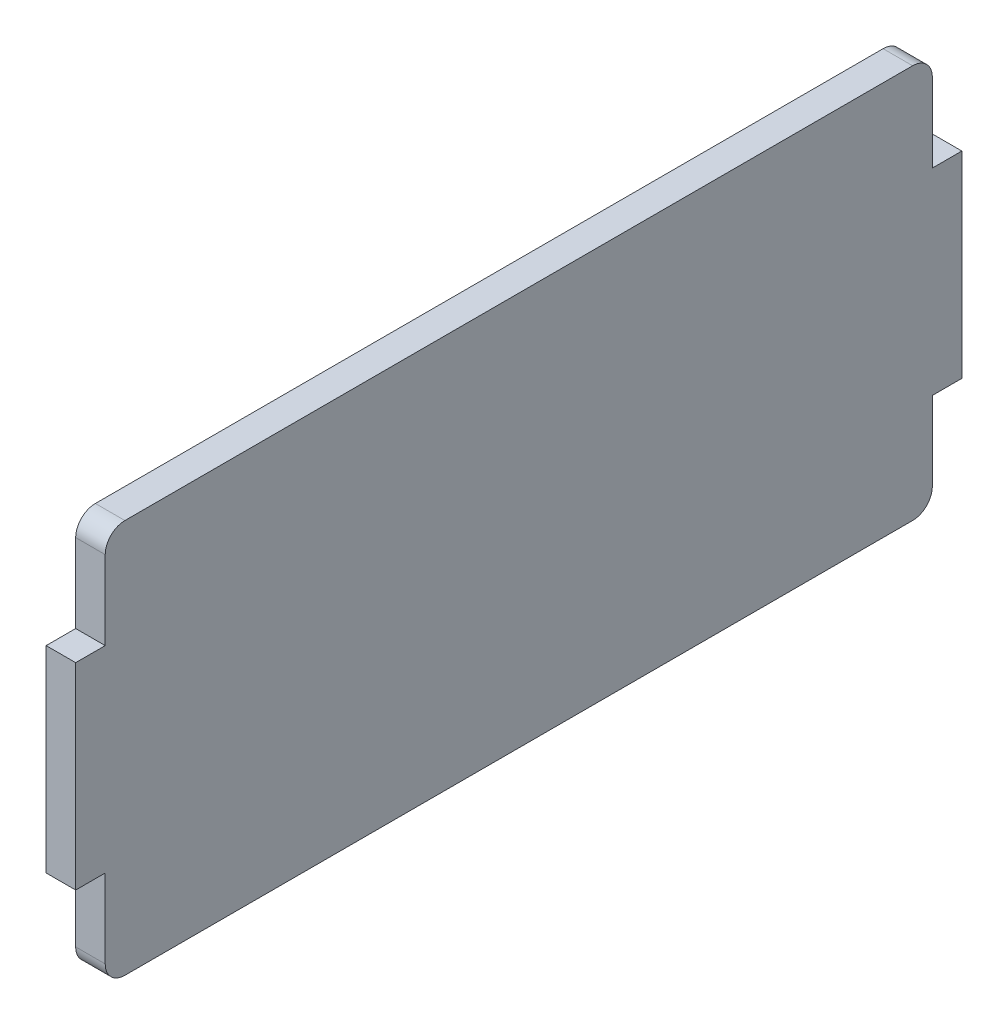
ISO-10303-21;
HEADER;
FILE_DESCRIPTION(('STEP AP214'),'2;1');
FILE_NAME('part.step','',(''),(''),'','','');
FILE_SCHEMA(('AUTOMOTIVE_DESIGN { 1 0 10303 214 1 1 1 1 }'));
ENDSEC;
DATA;
#1=APPLICATION_CONTEXT('core data for automotive mechanical design processes');
#2=APPLICATION_PROTOCOL_DEFINITION('international standard','automotive_design',2000,#1);
#3=PRODUCT_CONTEXT('',#1,'mechanical');
#4=PRODUCT('Part','Part','',(#3));
#5=PRODUCT_RELATED_PRODUCT_CATEGORY('part','',(#4));
#6=PRODUCT_DEFINITION_FORMATION('','',#4);
#7=PRODUCT_DEFINITION_CONTEXT('part definition',#1,'design');
#8=PRODUCT_DEFINITION('design','',#6,#7);
#9=PRODUCT_DEFINITION_SHAPE('','',#8);
#10=(LENGTH_UNIT() NAMED_UNIT(*) SI_UNIT(.MILLI.,.METRE.));
#11=(NAMED_UNIT(*) PLANE_ANGLE_UNIT() SI_UNIT($,.RADIAN.));
#12=(NAMED_UNIT(*) SI_UNIT($,.STERADIAN.) SOLID_ANGLE_UNIT());
#13=UNCERTAINTY_MEASURE_WITH_UNIT(LENGTH_MEASURE(1.E-05),#10,'distance_accuracy_value','');
#14=(GEOMETRIC_REPRESENTATION_CONTEXT(3) GLOBAL_UNCERTAINTY_ASSIGNED_CONTEXT((#13)) GLOBAL_UNIT_ASSIGNED_CONTEXT((#10,
#11,#12)) REPRESENTATION_CONTEXT('',''));
#15=CARTESIAN_POINT('',(0.,0.,0.));
#16=DIRECTION('',(0.,0.,1.));
#17=DIRECTION('',(1.,0.,0.));
#18=AXIS2_PLACEMENT_3D('',#15,#16,#17);
#19=CARTESIAN_POINT('',(86.0851063829788,-65.6022940152647,-128.612342240263));
#20=DIRECTION('',(0.,1.,0.));
#21=DIRECTION('',(0.,0.,1.));
#22=AXIS2_PLACEMENT_3D('',#19,#20,#21);
#23=PLANE('',#22);
#24=DIRECTION('',(0.,0.,1.));
#25=VECTOR('',#24,1.);
#26=CARTESIAN_POINT('',(83.0851063829788,-65.6022940152647,-128.612342240263));
#27=LINE('',#26,#25);
#28=CARTESIAN_POINT('',(83.0851063829788,-65.6022940152647,-83.5));
#29=VERTEX_POINT('',#28);
#30=CARTESIAN_POINT('',(83.0851063829788,-65.6022940152647,-3.5));
#31=VERTEX_POINT('',#30);
#32=EDGE_CURVE('E209',#29,#31,#27,.T.);
#33=ORIENTED_EDGE('',*,*,#32,.F.);
#34=DIRECTION('',(1.,0.,0.));
#35=VECTOR('',#34,1.);
#36=CARTESIAN_POINT('',(86.0851063829788,-65.6022940152647,-83.5));
#37=LINE('',#36,#35);
#38=CARTESIAN_POINT('',(86.0851063829788,-65.6022940152647,-83.5));
#39=VERTEX_POINT('',#38);
#40=EDGE_CURVE('E254',#29,#39,#37,.T.);
#41=ORIENTED_EDGE('',*,*,#40,.T.);
#42=DIRECTION('',(0.,0.,1.));
#43=VECTOR('',#42,1.);
#44=CARTESIAN_POINT('',(86.0851063829788,-65.6022940152647,-128.612342240263));
#45=LINE('',#44,#43);
#46=CARTESIAN_POINT('',(86.0851063829788,-65.6022940152647,-3.5));
#47=VERTEX_POINT('',#46);
#48=EDGE_CURVE('E215',#39,#47,#45,.T.);
#49=ORIENTED_EDGE('',*,*,#48,.T.);
#50=DIRECTION('',(1.,0.,0.));
#51=VECTOR('',#50,1.);
#52=CARTESIAN_POINT('',(83.0851063829788,-65.6022940152647,-3.5));
#53=LINE('',#52,#51);
#54=EDGE_CURVE('E252',#47,#31,#53,.F.);
#55=ORIENTED_EDGE('',*,*,#54,.T.);
#56=EDGE_LOOP('',(#33,#41,#49,#55));
#57=FACE_BOUND('',#56,.T.);
#58=ADVANCED_FACE('F33',(#57),#23,.F.);
#59=CARTESIAN_POINT('',(86.0851063829788,-25.6022940152647,-128.612342240263));
#60=DIRECTION('',(-1.,0.,0.));
#61=DIRECTION('',(0.,0.,1.));
#62=AXIS2_PLACEMENT_3D('',#59,#60,#61);
#63=PLANE('',#62);
#64=DIRECTION('',(0.,1.,0.));
#65=VECTOR('',#64,1.);
#66=CARTESIAN_POINT('',(86.0851063829788,0.,-85.5));
#67=LINE('',#66,#65);
#68=CARTESIAN_POINT('',(86.0851063829788,-35.6022940152646,-85.5));
#69=VERTEX_POINT('',#68);
#70=CARTESIAN_POINT('',(86.0851063829788,-27.6022940152647,-85.5));
#71=VERTEX_POINT('',#70);
#72=EDGE_CURVE('E154',#69,#71,#67,.T.);
#73=ORIENTED_EDGE('',*,*,#72,.T.);
#74=CARTESIAN_POINT('',(86.0851063829788,-27.6022940152647,-83.5));
#75=DIRECTION('',(-1.,0.,0.));
#76=DIRECTION('',(0.,0.,1.));
#77=AXIS2_PLACEMENT_3D('',#74,#75,#76);
#78=CIRCLE('',#77,2.);
#79=CARTESIAN_POINT('',(86.0851063829788,-25.6022940152647,-83.5));
#80=VERTEX_POINT('',#79);
#81=EDGE_CURVE('E250',#71,#80,#78,.F.);
#82=ORIENTED_EDGE('',*,*,#81,.T.);
#83=DIRECTION('',(0.,0.,1.));
#84=VECTOR('',#83,1.);
#85=CARTESIAN_POINT('',(86.0851063829788,-25.6022940152647,-128.612342240263));
#86=LINE('',#85,#84);
#87=CARTESIAN_POINT('',(86.0851063829788,-25.6022940152647,-3.5));
#88=VERTEX_POINT('',#87);
#89=EDGE_CURVE('E212',#80,#88,#86,.T.);
#90=ORIENTED_EDGE('',*,*,#89,.T.);
#91=CARTESIAN_POINT('',(86.0851063829788,-27.6022940152647,-3.5));
#92=DIRECTION('',(-1.,0.,0.));
#93=DIRECTION('',(0.,0.,1.));
#94=AXIS2_PLACEMENT_3D('',#91,#92,#93);
#95=CIRCLE('',#94,2.);
#96=CARTESIAN_POINT('',(86.0851063829788,-27.6022940152647,-1.5));
#97=VERTEX_POINT('',#96);
#98=EDGE_CURVE('E246',#88,#97,#95,.F.);
#99=ORIENTED_EDGE('',*,*,#98,.T.);
#100=DIRECTION('',(0.,1.,0.));
#101=VECTOR('',#100,1.);
#102=CARTESIAN_POINT('',(86.0851063829787,0.,-1.5));
#103=LINE('',#102,#101);
#104=CARTESIAN_POINT('',(86.0851063829788,-35.6022940152646,-1.5));
#105=VERTEX_POINT('',#104);
#106=EDGE_CURVE('E187',#105,#97,#103,.T.);
#107=ORIENTED_EDGE('',*,*,#106,.F.);
#108=DIRECTION('',(0.,0.,1.));
#109=VECTOR('',#108,1.);
#110=CARTESIAN_POINT('',(86.0851063829788,-35.6022940152646,1.5));
#111=LINE('',#110,#109);
#112=CARTESIAN_POINT('',(86.0851063829788,-35.6022940152646,1.5));
#113=VERTEX_POINT('',#112);
#114=EDGE_CURVE('E184',#105,#113,#111,.T.);
#115=ORIENTED_EDGE('',*,*,#114,.T.);
#116=DIRECTION('',(0.,1.,0.));
#117=VECTOR('',#116,1.);
#118=CARTESIAN_POINT('',(86.0851063829788,-25.6022940152647,1.5));
#119=LINE('',#118,#117);
#120=CARTESIAN_POINT('',(86.0851063829788,-55.6022940152646,1.5));
#121=VERTEX_POINT('',#120);
#122=EDGE_CURVE('E206',#113,#121,#119,.F.);
#123=ORIENTED_EDGE('',*,*,#122,.T.);
#124=DIRECTION('',(0.,0.,-1.));
#125=VECTOR('',#124,1.);
#126=CARTESIAN_POINT('',(86.0851063829788,-55.6022940152646,1.5));
#127=LINE('',#126,#125);
#128=CARTESIAN_POINT('',(86.0851063829788,-55.6022940152646,-1.5));
#129=VERTEX_POINT('',#128);
#130=EDGE_CURVE('E181',#121,#129,#127,.T.);
#131=ORIENTED_EDGE('',*,*,#130,.T.);
#132=CARTESIAN_POINT('',(86.0851063829788,-63.6022940152647,-1.5));
#133=VERTEX_POINT('',#132);
#134=EDGE_CURVE('E188',#133,#129,#103,.T.);
#135=ORIENTED_EDGE('',*,*,#134,.F.);
#136=CARTESIAN_POINT('',(86.0851063829788,-63.6022940152647,-3.5));
#137=DIRECTION('',(-1.,0.,0.));
#138=DIRECTION('',(0.,0.,1.));
#139=AXIS2_PLACEMENT_3D('',#136,#137,#138);
#140=CIRCLE('',#139,2.);
#141=EDGE_CURVE('E54',#133,#47,#140,.F.);
#142=ORIENTED_EDGE('',*,*,#141,.T.);
#143=ORIENTED_EDGE('',*,*,#48,.F.);
#144=CARTESIAN_POINT('',(86.0851063829788,-63.6022940152647,-83.5));
#145=DIRECTION('',(-1.,0.,0.));
#146=DIRECTION('',(0.,0.,1.));
#147=AXIS2_PLACEMENT_3D('',#144,#145,#146);
#148=CIRCLE('',#147,2.);
#149=CARTESIAN_POINT('',(86.0851063829788,-63.6022940152647,-85.5));
#150=VERTEX_POINT('',#149);
#151=EDGE_CURVE('E48',#39,#150,#148,.F.);
#152=ORIENTED_EDGE('',*,*,#151,.T.);
#153=CARTESIAN_POINT('',(86.0851063829788,-55.6022940152646,-85.5));
#154=VERTEX_POINT('',#153);
#155=EDGE_CURVE('E143',#150,#154,#67,.T.);
#156=ORIENTED_EDGE('',*,*,#155,.T.);
#157=DIRECTION('',(0.,0.,-1.));
#158=VECTOR('',#157,1.);
#159=CARTESIAN_POINT('',(86.0851063829788,-55.6022940152646,-85.5));
#160=LINE('',#159,#158);
#161=CARTESIAN_POINT('',(86.0851063829788,-55.6022940152646,-88.5));
#162=VERTEX_POINT('',#161);
#163=EDGE_CURVE('E149',#154,#162,#160,.T.);
#164=ORIENTED_EDGE('',*,*,#163,.T.);
#165=DIRECTION('',(0.,1.,0.));
#166=VECTOR('',#165,1.);
#167=CARTESIAN_POINT('',(86.0851063829788,-25.6022940152647,-88.5));
#168=LINE('',#167,#166);
#169=CARTESIAN_POINT('',(86.0851063829788,-35.6022940152646,-88.5));
#170=VERTEX_POINT('',#169);
#171=EDGE_CURVE('E197',#162,#170,#168,.T.);
#172=ORIENTED_EDGE('',*,*,#171,.T.);
#173=DIRECTION('',(0.,0.,1.));
#174=VECTOR('',#173,1.);
#175=CARTESIAN_POINT('',(86.0851063829788,-35.6022940152646,-85.5));
#176=LINE('',#175,#174);
#177=EDGE_CURVE('E167',#170,#69,#176,.T.);
#178=ORIENTED_EDGE('',*,*,#177,.T.);
#179=EDGE_LOOP('',(#73,#82,#90,#99,#107,#115,#123,#131,#135,#142,#143,#152,#156,#164,#172,#178));
#180=FACE_BOUND('',#179,.T.);
#181=ADVANCED_FACE('F146',(#180),#63,.F.);
#182=CARTESIAN_POINT('',(83.0851063829788,-25.6022940152647,-128.612342240263));
#183=DIRECTION('',(0.,-1.,0.));
#184=DIRECTION('',(0.,0.,-1.));
#185=AXIS2_PLACEMENT_3D('',#182,#183,#184);
#186=PLANE('',#185);
#187=ORIENTED_EDGE('',*,*,#89,.F.);
#188=DIRECTION('',(-1.,0.,0.));
#189=VECTOR('',#188,1.);
#190=CARTESIAN_POINT('',(83.0851063829788,-25.6022940152647,-83.5));
#191=LINE('',#190,#189);
#192=CARTESIAN_POINT('',(83.0851063829788,-25.6022940152647,-83.5));
#193=VERTEX_POINT('',#192);
#194=EDGE_CURVE('E233',#80,#193,#191,.T.);
#195=ORIENTED_EDGE('',*,*,#194,.T.);
#196=DIRECTION('',(0.,0.,1.));
#197=VECTOR('',#196,1.);
#198=CARTESIAN_POINT('',(83.0851063829788,-25.6022940152647,-128.612342240263));
#199=LINE('',#198,#197);
#200=CARTESIAN_POINT('',(83.0851063829788,-25.6022940152647,-3.5));
#201=VERTEX_POINT('',#200);
#202=EDGE_CURVE('E200',#193,#201,#199,.T.);
#203=ORIENTED_EDGE('',*,*,#202,.T.);
#204=DIRECTION('',(-1.,0.,0.));
#205=VECTOR('',#204,1.);
#206=CARTESIAN_POINT('',(86.0851063829788,-25.6022940152647,-3.5));
#207=LINE('',#206,#205);
#208=EDGE_CURVE('E231',#201,#88,#207,.F.);
#209=ORIENTED_EDGE('',*,*,#208,.T.);
#210=EDGE_LOOP('',(#187,#195,#203,#209));
#211=FACE_BOUND('',#210,.T.);
#212=ADVANCED_FACE('F308',(#211),#186,.F.);
#213=CARTESIAN_POINT('',(83.0851063829788,-25.6022940152647,-128.612342240263));
#214=DIRECTION('',(-1.,0.,0.));
#215=DIRECTION('',(0.,0.,1.));
#216=AXIS2_PLACEMENT_3D('',#213,#214,#215);
#217=PLANE('',#216);
#218=ORIENTED_EDGE('',*,*,#202,.F.);
#219=CARTESIAN_POINT('',(83.0851063829788,-27.6022940152647,-83.5));
#220=DIRECTION('',(-1.,0.,0.));
#221=DIRECTION('',(0.,0.,1.));
#222=AXIS2_PLACEMENT_3D('',#219,#220,#221);
#223=CIRCLE('',#222,2.);
#224=CARTESIAN_POINT('',(83.0851063829788,-27.6022940152647,-85.5));
#225=VERTEX_POINT('',#224);
#226=EDGE_CURVE('E242',#193,#225,#223,.T.);
#227=ORIENTED_EDGE('',*,*,#226,.T.);
#228=DIRECTION('',(0.,1.,0.));
#229=VECTOR('',#228,1.);
#230=CARTESIAN_POINT('',(83.0851063829788,-25.6022940152647,-85.5));
#231=LINE('',#230,#229);
#232=CARTESIAN_POINT('',(83.0851063829788,-35.6022940152646,-85.5));
#233=VERTEX_POINT('',#232);
#234=EDGE_CURVE('E230',#233,#225,#231,.T.);
#235=ORIENTED_EDGE('',*,*,#234,.F.);
#236=DIRECTION('',(0.,0.,1.));
#237=VECTOR('',#236,1.);
#238=CARTESIAN_POINT('',(83.0851063829788,-35.6022940152646,-128.612342240263));
#239=LINE('',#238,#237);
#240=CARTESIAN_POINT('',(83.0851063829788,-35.6022940152646,-88.5));
#241=VERTEX_POINT('',#240);
#242=EDGE_CURVE('E194',#241,#233,#239,.T.);
#243=ORIENTED_EDGE('',*,*,#242,.F.);
#244=DIRECTION('',(0.,1.,0.));
#245=VECTOR('',#244,1.);
#246=CARTESIAN_POINT('',(83.0851063829788,-25.6022940152647,-88.5));
#247=LINE('',#246,#245);
#248=CARTESIAN_POINT('',(83.0851063829788,-55.6022940152646,-88.5));
#249=VERTEX_POINT('',#248);
#250=EDGE_CURVE('E199',#249,#241,#247,.T.);
#251=ORIENTED_EDGE('',*,*,#250,.F.);
#252=DIRECTION('',(0.,0.,-1.));
#253=VECTOR('',#252,1.);
#254=CARTESIAN_POINT('',(83.0851063829788,-55.6022940152646,-128.612342240263));
#255=LINE('',#254,#253);
#256=CARTESIAN_POINT('',(83.0851063829788,-55.6022940152646,-85.5));
#257=VERTEX_POINT('',#256);
#258=EDGE_CURVE('E174',#257,#249,#255,.T.);
#259=ORIENTED_EDGE('',*,*,#258,.F.);
#260=CARTESIAN_POINT('',(83.0851063829788,-63.6022940152647,-85.5));
#261=VERTEX_POINT('',#260);
#262=EDGE_CURVE('E160',#261,#257,#231,.T.);
#263=ORIENTED_EDGE('',*,*,#262,.F.);
#264=CARTESIAN_POINT('',(83.0851063829788,-63.6022940152647,-83.5));
#265=DIRECTION('',(-1.,0.,0.));
#266=DIRECTION('',(0.,0.,1.));
#267=AXIS2_PLACEMENT_3D('',#264,#265,#266);
#268=CIRCLE('',#267,2.);
#269=EDGE_CURVE('E240',#261,#29,#268,.T.);
#270=ORIENTED_EDGE('',*,*,#269,.T.);
#271=ORIENTED_EDGE('',*,*,#32,.T.);
#272=CARTESIAN_POINT('',(83.0851063829788,-63.6022940152647,-3.5));
#273=DIRECTION('',(-1.,0.,0.));
#274=DIRECTION('',(0.,0.,1.));
#275=AXIS2_PLACEMENT_3D('',#272,#273,#274);
#276=CIRCLE('',#275,2.);
#277=CARTESIAN_POINT('',(83.0851063829788,-63.6022940152647,-1.5));
#278=VERTEX_POINT('',#277);
#279=EDGE_CURVE('E238',#31,#278,#276,.T.);
#280=ORIENTED_EDGE('',*,*,#279,.T.);
#281=DIRECTION('',(0.,1.,0.));
#282=VECTOR('',#281,1.);
#283=CARTESIAN_POINT('',(83.0851063829788,-25.6022940152647,-1.5));
#284=LINE('',#283,#282);
#285=CARTESIAN_POINT('',(83.0851063829788,-55.6022940152646,-1.5));
#286=VERTEX_POINT('',#285);
#287=EDGE_CURVE('E224',#278,#286,#284,.T.);
#288=ORIENTED_EDGE('',*,*,#287,.T.);
#289=DIRECTION('',(0.,0.,-1.));
#290=VECTOR('',#289,1.);
#291=CARTESIAN_POINT('',(83.0851063829788,-55.6022940152646,-128.612342240263));
#292=LINE('',#291,#290);
#293=CARTESIAN_POINT('',(83.0851063829788,-55.6022940152646,1.5));
#294=VERTEX_POINT('',#293);
#295=EDGE_CURVE('E221',#294,#286,#292,.T.);
#296=ORIENTED_EDGE('',*,*,#295,.F.);
#297=DIRECTION('',(0.,1.,0.));
#298=VECTOR('',#297,1.);
#299=CARTESIAN_POINT('',(83.0851063829788,-25.6022940152647,1.5));
#300=LINE('',#299,#298);
#301=CARTESIAN_POINT('',(83.0851063829788,-35.6022940152646,1.5));
#302=VERTEX_POINT('',#301);
#303=EDGE_CURVE('E196',#302,#294,#300,.F.);
#304=ORIENTED_EDGE('',*,*,#303,.F.);
#305=DIRECTION('',(0.,0.,1.));
#306=VECTOR('',#305,1.);
#307=CARTESIAN_POINT('',(83.0851063829788,-35.6022940152646,-128.612342240263));
#308=LINE('',#307,#306);
#309=CARTESIAN_POINT('',(83.0851063829788,-35.6022940152646,-1.5));
#310=VERTEX_POINT('',#309);
#311=EDGE_CURVE('E226',#310,#302,#308,.T.);
#312=ORIENTED_EDGE('',*,*,#311,.F.);
#313=CARTESIAN_POINT('',(83.0851063829788,-27.6022940152647,-1.5));
#314=VERTEX_POINT('',#313);
#315=EDGE_CURVE('E227',#310,#314,#284,.T.);
#316=ORIENTED_EDGE('',*,*,#315,.T.);
#317=CARTESIAN_POINT('',(83.0851063829788,-27.6022940152647,-3.5));
#318=DIRECTION('',(-1.,0.,0.));
#319=DIRECTION('',(0.,0.,1.));
#320=AXIS2_PLACEMENT_3D('',#317,#318,#319);
#321=CIRCLE('',#320,2.);
#322=EDGE_CURVE('E236',#314,#201,#321,.T.);
#323=ORIENTED_EDGE('',*,*,#322,.T.);
#324=EDGE_LOOP('',(#218,#227,#235,#243,#251,#259,#263,#270,#271,#280,#288,#296,#304,#312,#316,#323));
#325=FACE_BOUND('',#324,.T.);
#326=ADVANCED_FACE('F278',(#325),#217,.T.);
#327=CARTESIAN_POINT('',(0.,0.,1.5));
#328=DIRECTION('',(0.,0.,1.));
#329=DIRECTION('',(1.,0.,0.));
#330=AXIS2_PLACEMENT_3D('',#327,#328,#329);
#331=PLANE('',#330);
#332=DIRECTION('',(1.,0.,0.));
#333=VECTOR('',#332,1.);
#334=CARTESIAN_POINT('',(82.9951063829788,-35.6022940152646,1.5));
#335=LINE('',#334,#333);
#336=EDGE_CURVE('E177',#302,#113,#335,.T.);
#337=ORIENTED_EDGE('',*,*,#336,.F.);
#338=ORIENTED_EDGE('',*,*,#303,.T.);
#339=DIRECTION('',(-1.,0.,0.));
#340=VECTOR('',#339,1.);
#341=CARTESIAN_POINT('',(86.1751063829788,-55.6022940152646,1.5));
#342=LINE('',#341,#340);
#343=EDGE_CURVE('E179',#121,#294,#342,.T.);
#344=ORIENTED_EDGE('',*,*,#343,.F.);
#345=ORIENTED_EDGE('',*,*,#122,.F.);
#346=EDGE_LOOP('',(#337,#338,#344,#345));
#347=FACE_BOUND('',#346,.T.);
#348=ADVANCED_FACE('F273',(#347),#331,.T.);
#349=CARTESIAN_POINT('',(0.,0.,-88.5));
#350=DIRECTION('',(0.,0.,1.));
#351=DIRECTION('',(1.,0.,0.));
#352=AXIS2_PLACEMENT_3D('',#349,#350,#351);
#353=PLANE('',#352);
#354=ORIENTED_EDGE('',*,*,#250,.T.);
#355=DIRECTION('',(1.,0.,0.));
#356=VECTOR('',#355,1.);
#357=CARTESIAN_POINT('',(0.,-35.6022940152646,-88.5));
#358=LINE('',#357,#356);
#359=EDGE_CURVE('E203',#241,#170,#358,.T.);
#360=ORIENTED_EDGE('',*,*,#359,.T.);
#361=ORIENTED_EDGE('',*,*,#171,.F.);
#362=DIRECTION('',(-1.,0.,0.));
#363=VECTOR('',#362,1.);
#364=CARTESIAN_POINT('',(0.,-55.6022940152646,-88.5));
#365=LINE('',#364,#363);
#366=EDGE_CURVE('E153',#162,#249,#365,.T.);
#367=ORIENTED_EDGE('',*,*,#366,.T.);
#368=EDGE_LOOP('',(#354,#360,#361,#367));
#369=FACE_BOUND('',#368,.T.);
#370=ADVANCED_FACE('F291',(#369),#353,.F.);
#371=CARTESIAN_POINT('',(86.1751063829788,-55.6022940152646,-88.5));
#372=DIRECTION('',(0.,1.,0.));
#373=DIRECTION('',(0.,0.,1.));
#374=AXIS2_PLACEMENT_3D('',#371,#372,#373);
#375=PLANE('',#374);
#376=ORIENTED_EDGE('',*,*,#258,.T.);
#377=ORIENTED_EDGE('',*,*,#366,.F.);
#378=ORIENTED_EDGE('',*,*,#163,.F.);
#379=DIRECTION('',(-1.,0.,0.));
#380=VECTOR('',#379,1.);
#381=CARTESIAN_POINT('',(86.1751063829788,-55.6022940152646,-85.5));
#382=LINE('',#381,#380);
#383=EDGE_CURVE('E157',#154,#257,#382,.T.);
#384=ORIENTED_EDGE('',*,*,#383,.T.);
#385=EDGE_LOOP('',(#376,#377,#378,#384));
#386=FACE_BOUND('',#385,.T.);
#387=ADVANCED_FACE('F165',(#386),#375,.F.);
#388=CARTESIAN_POINT('',(0.,0.,-85.5));
#389=DIRECTION('',(0.,0.,1.));
#390=DIRECTION('',(1.,0.,0.));
#391=AXIS2_PLACEMENT_3D('',#388,#389,#390);
#392=PLANE('',#391);
#393=ORIENTED_EDGE('',*,*,#155,.F.);
#394=DIRECTION('',(1.,0.,0.));
#395=VECTOR('',#394,1.);
#396=CARTESIAN_POINT('',(0.,-63.6022940152647,-85.5));
#397=LINE('',#396,#395);
#398=EDGE_CURVE('E257',#150,#261,#397,.F.);
#399=ORIENTED_EDGE('',*,*,#398,.T.);
#400=ORIENTED_EDGE('',*,*,#262,.T.);
#401=ORIENTED_EDGE('',*,*,#383,.F.);
#402=EDGE_LOOP('',(#393,#399,#400,#401));
#403=FACE_BOUND('',#402,.T.);
#404=ADVANCED_FACE('F158',(#403),#392,.F.);
#405=ORIENTED_EDGE('',*,*,#234,.T.);
#406=DIRECTION('',(-1.,0.,0.));
#407=VECTOR('',#406,1.);
#408=CARTESIAN_POINT('',(0.,-27.6022940152647,-85.5));
#409=LINE('',#408,#407);
#410=EDGE_CURVE('E244',#225,#71,#409,.F.);
#411=ORIENTED_EDGE('',*,*,#410,.T.);
#412=ORIENTED_EDGE('',*,*,#72,.F.);
#413=DIRECTION('',(1.,0.,0.));
#414=VECTOR('',#413,1.);
#415=CARTESIAN_POINT('',(82.9951063829788,-35.6022940152646,-85.5));
#416=LINE('',#415,#414);
#417=EDGE_CURVE('E163',#233,#69,#416,.T.);
#418=ORIENTED_EDGE('',*,*,#417,.F.);
#419=EDGE_LOOP('',(#405,#411,#412,#418));
#420=FACE_BOUND('',#419,.T.);
#421=ADVANCED_FACE('F300',(#420),#392,.F.);
#422=CARTESIAN_POINT('',(82.9951063829788,-35.6022940152646,-88.5));
#423=DIRECTION('',(0.,-1.,0.));
#424=DIRECTION('',(0.,0.,-1.));
#425=AXIS2_PLACEMENT_3D('',#422,#423,#424);
#426=PLANE('',#425);
#427=ORIENTED_EDGE('',*,*,#242,.T.);
#428=ORIENTED_EDGE('',*,*,#417,.T.);
#429=ORIENTED_EDGE('',*,*,#177,.F.);
#430=ORIENTED_EDGE('',*,*,#359,.F.);
#431=EDGE_LOOP('',(#427,#428,#429,#430));
#432=FACE_BOUND('',#431,.T.);
#433=ADVANCED_FACE('F295',(#432),#426,.F.);
#434=CARTESIAN_POINT('',(86.1751063829788,-55.6022940152646,-1.5));
#435=DIRECTION('',(0.,1.,0.));
#436=DIRECTION('',(0.,0.,1.));
#437=AXIS2_PLACEMENT_3D('',#434,#435,#436);
#438=PLANE('',#437);
#439=ORIENTED_EDGE('',*,*,#295,.T.);
#440=DIRECTION('',(-1.,0.,0.));
#441=VECTOR('',#440,1.);
#442=CARTESIAN_POINT('',(0.,-55.6022940152646,-1.5));
#443=LINE('',#442,#441);
#444=EDGE_CURVE('E190',#129,#286,#443,.T.);
#445=ORIENTED_EDGE('',*,*,#444,.F.);
#446=ORIENTED_EDGE('',*,*,#130,.F.);
#447=ORIENTED_EDGE('',*,*,#343,.T.);
#448=EDGE_LOOP('',(#439,#445,#446,#447));
#449=FACE_BOUND('',#448,.T.);
#450=ADVANCED_FACE('F269',(#449),#438,.F.);
#451=CARTESIAN_POINT('',(0.,0.,-1.5));
#452=DIRECTION('',(0.,0.,1.));
#453=DIRECTION('',(1.,0.,0.));
#454=AXIS2_PLACEMENT_3D('',#451,#452,#453);
#455=PLANE('',#454);
#456=ORIENTED_EDGE('',*,*,#287,.F.);
#457=DIRECTION('',(1.,0.,0.));
#458=VECTOR('',#457,1.);
#459=CARTESIAN_POINT('',(86.0851063829788,-63.6022940152647,-1.5));
#460=LINE('',#459,#458);
#461=EDGE_CURVE('E41',#278,#133,#460,.T.);
#462=ORIENTED_EDGE('',*,*,#461,.T.);
#463=ORIENTED_EDGE('',*,*,#134,.T.);
#464=ORIENTED_EDGE('',*,*,#444,.T.);
#465=EDGE_LOOP('',(#456,#462,#463,#464));
#466=FACE_BOUND('',#465,.T.);
#467=ADVANCED_FACE('F262',(#466),#455,.T.);
#468=ORIENTED_EDGE('',*,*,#106,.T.);
#469=DIRECTION('',(-1.,0.,0.));
#470=VECTOR('',#469,1.);
#471=CARTESIAN_POINT('',(83.0851063829788,-27.6022940152647,-1.5));
#472=LINE('',#471,#470);
#473=EDGE_CURVE('E11',#97,#314,#472,.T.);
#474=ORIENTED_EDGE('',*,*,#473,.T.);
#475=ORIENTED_EDGE('',*,*,#315,.F.);
#476=DIRECTION('',(1.,0.,0.));
#477=VECTOR('',#476,1.);
#478=CARTESIAN_POINT('',(82.9951063829788,-35.6022940152646,-1.5));
#479=LINE('',#478,#477);
#480=EDGE_CURVE('E175',#310,#105,#479,.T.);
#481=ORIENTED_EDGE('',*,*,#480,.T.);
#482=EDGE_LOOP('',(#468,#474,#475,#481));
#483=FACE_BOUND('',#482,.T.);
#484=ADVANCED_FACE('F315',(#483),#455,.T.);
#485=CARTESIAN_POINT('',(82.9951063829788,-35.6022940152646,-1.5));
#486=DIRECTION('',(0.,-1.,0.));
#487=DIRECTION('',(0.,0.,-1.));
#488=AXIS2_PLACEMENT_3D('',#485,#486,#487);
#489=PLANE('',#488);
#490=ORIENTED_EDGE('',*,*,#311,.T.);
#491=ORIENTED_EDGE('',*,*,#336,.T.);
#492=ORIENTED_EDGE('',*,*,#114,.F.);
#493=ORIENTED_EDGE('',*,*,#480,.F.);
#494=EDGE_LOOP('',(#490,#491,#492,#493));
#495=FACE_BOUND('',#494,.T.);
#496=ADVANCED_FACE('F319',(#495),#489,.F.);
#497=CARTESIAN_POINT('',(83.0851063829788,-27.6022940152647,-83.5));
#498=DIRECTION('',(-1.,0.,0.));
#499=DIRECTION('',(0.,0.,1.));
#500=AXIS2_PLACEMENT_3D('',#497,#498,#499);
#501=CYLINDRICAL_SURFACE('',#500,2.);
#502=ORIENTED_EDGE('',*,*,#81,.F.);
#503=ORIENTED_EDGE('',*,*,#410,.F.);
#504=ORIENTED_EDGE('',*,*,#226,.F.);
#505=ORIENTED_EDGE('',*,*,#194,.F.);
#506=EDGE_LOOP('',(#502,#503,#504,#505));
#507=FACE_BOUND('',#506,.T.);
#508=ADVANCED_FACE('F303',(#507),#501,.T.);
#509=CARTESIAN_POINT('',(86.0851063829788,-63.6022940152647,-83.5));
#510=DIRECTION('',(1.,0.,0.));
#511=DIRECTION('',(0.,0.,-1.));
#512=AXIS2_PLACEMENT_3D('',#509,#510,#511);
#513=CYLINDRICAL_SURFACE('',#512,2.);
#514=ORIENTED_EDGE('',*,*,#269,.F.);
#515=ORIENTED_EDGE('',*,*,#398,.F.);
#516=ORIENTED_EDGE('',*,*,#151,.F.);
#517=ORIENTED_EDGE('',*,*,#40,.F.);
#518=EDGE_LOOP('',(#514,#515,#516,#517));
#519=FACE_BOUND('',#518,.T.);
#520=ADVANCED_FACE('F287',(#519),#513,.T.);
#521=CARTESIAN_POINT('',(0.,-63.6022940152647,-3.5));
#522=DIRECTION('',(-1.,0.,0.));
#523=DIRECTION('',(0.,0.,1.));
#524=AXIS2_PLACEMENT_3D('',#521,#522,#523);
#525=CYLINDRICAL_SURFACE('',#524,2.);
#526=ORIENTED_EDGE('',*,*,#279,.F.);
#527=ORIENTED_EDGE('',*,*,#54,.F.);
#528=ORIENTED_EDGE('',*,*,#141,.F.);
#529=ORIENTED_EDGE('',*,*,#461,.F.);
#530=EDGE_LOOP('',(#526,#527,#528,#529));
#531=FACE_BOUND('',#530,.T.);
#532=ADVANCED_FACE('F282',(#531),#525,.T.);
#533=CARTESIAN_POINT('',(0.,-27.6022940152647,-3.5));
#534=DIRECTION('',(1.,0.,0.));
#535=DIRECTION('',(0.,0.,-1.));
#536=AXIS2_PLACEMENT_3D('',#533,#534,#535);
#537=CYLINDRICAL_SURFACE('',#536,2.);
#538=ORIENTED_EDGE('',*,*,#98,.F.);
#539=ORIENTED_EDGE('',*,*,#208,.F.);
#540=ORIENTED_EDGE('',*,*,#322,.F.);
#541=ORIENTED_EDGE('',*,*,#473,.F.);
#542=EDGE_LOOP('',(#538,#539,#540,#541));
#543=FACE_BOUND('',#542,.T.);
#544=ADVANCED_FACE('F35',(#543),#537,.T.);
#545=CLOSED_SHELL('',(#58,#181,#212,#326,#348,#370,#387,#404,#421,#433,#450,#467,#484,#496,#508,
#520,#532,#544));
#546=MANIFOLD_SOLID_BREP('B2',#545);
#547=ADVANCED_BREP_SHAPE_REPRESENTATION('',(#18,#546),#14);
#548=SHAPE_DEFINITION_REPRESENTATION(#9,#547);
ENDSEC;
END-ISO-10303-21;
